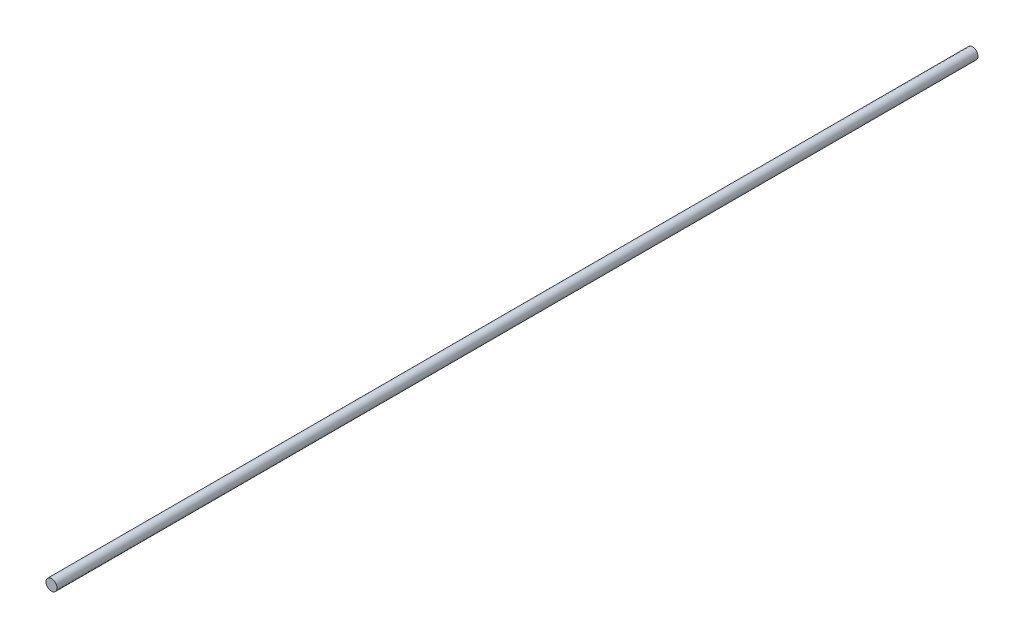
ISO-10303-21;
HEADER;
FILE_DESCRIPTION(('STEP AP214'),'2;1');
FILE_NAME('part.step','',(''),(''),'','','');
FILE_SCHEMA(('AUTOMOTIVE_DESIGN { 1 0 10303 214 1 1 1 1 }'));
ENDSEC;
DATA;
#1=APPLICATION_CONTEXT('core data for automotive mechanical design processes');
#2=APPLICATION_PROTOCOL_DEFINITION('international standard','automotive_design',2000,#1);
#3=PRODUCT_CONTEXT('',#1,'mechanical');
#4=PRODUCT('Part','Part','',(#3));
#5=PRODUCT_RELATED_PRODUCT_CATEGORY('part','',(#4));
#6=PRODUCT_DEFINITION_FORMATION('','',#4);
#7=PRODUCT_DEFINITION_CONTEXT('part definition',#1,'design');
#8=PRODUCT_DEFINITION('design','',#6,#7);
#9=PRODUCT_DEFINITION_SHAPE('','',#8);
#10=(LENGTH_UNIT() NAMED_UNIT(*) SI_UNIT(.MILLI.,.METRE.));
#11=(NAMED_UNIT(*) PLANE_ANGLE_UNIT() SI_UNIT($,.RADIAN.));
#12=(NAMED_UNIT(*) SI_UNIT($,.STERADIAN.) SOLID_ANGLE_UNIT());
#13=UNCERTAINTY_MEASURE_WITH_UNIT(LENGTH_MEASURE(1.E-05),#10,'distance_accuracy_value','');
#14=(GEOMETRIC_REPRESENTATION_CONTEXT(3) GLOBAL_UNCERTAINTY_ASSIGNED_CONTEXT((#13)) GLOBAL_UNIT_ASSIGNED_CONTEXT((#10,
#11,#12)) REPRESENTATION_CONTEXT('',''));
#15=CARTESIAN_POINT('',(0.,0.,0.));
#16=DIRECTION('',(0.,0.,1.));
#17=DIRECTION('',(1.,0.,0.));
#18=AXIS2_PLACEMENT_3D('',#15,#16,#17);
#19=CARTESIAN_POINT('',(0.,0.,532.435));
#20=DIRECTION('',(0.,0.,-1.));
#21=DIRECTION('',(-1.,0.,0.));
#22=AXIS2_PLACEMENT_3D('',#19,#20,#21);
#23=CYLINDRICAL_SURFACE('',#22,3.175);
#24=CARTESIAN_POINT('',(0.,0.,532.435));
#25=DIRECTION('',(0.,0.,1.));
#26=DIRECTION('',(1.,0.,0.));
#27=AXIS2_PLACEMENT_3D('',#24,#25,#26);
#28=CIRCLE('',#27,3.175);
#29=CARTESIAN_POINT('',(3.175,0.,532.435));
#30=VERTEX_POINT('',#29);
#31=EDGE_CURVE('E10',#30,#30,#28,.T.);
#32=ORIENTED_EDGE('',*,*,#31,.F.);
#33=EDGE_LOOP('',(#32));
#34=FACE_BOUND('',#33,.T.);
#35=CARTESIAN_POINT('',(0.,0.,0.));
#36=DIRECTION('',(0.,0.,1.));
#37=DIRECTION('',(1.,0.,0.));
#38=AXIS2_PLACEMENT_3D('',#35,#36,#37);
#39=CIRCLE('',#38,3.175);
#40=CARTESIAN_POINT('',(3.175,0.,0.));
#41=VERTEX_POINT('',#40);
#42=EDGE_CURVE('E38',#41,#41,#39,.T.);
#43=ORIENTED_EDGE('',*,*,#42,.T.);
#44=EDGE_LOOP('',(#43));
#45=FACE_BOUND('',#44,.T.);
#46=ADVANCED_FACE('F35',(#34,#45),#23,.T.);
#47=CARTESIAN_POINT('',(0.,0.,532.435));
#48=DIRECTION('',(0.,0.,1.));
#49=DIRECTION('',(1.,0.,0.));
#50=AXIS2_PLACEMENT_3D('',#47,#48,#49);
#51=PLANE('',#50);
#52=ORIENTED_EDGE('',*,*,#31,.T.);
#53=EDGE_LOOP('',(#52));
#54=FACE_BOUND('',#53,.T.);
#55=ADVANCED_FACE('F50',(#54),#51,.T.);
#56=CARTESIAN_POINT('',(0.,0.,0.));
#57=DIRECTION('',(0.,0.,1.));
#58=DIRECTION('',(1.,0.,0.));
#59=AXIS2_PLACEMENT_3D('',#56,#57,#58);
#60=PLANE('',#59);
#61=ORIENTED_EDGE('',*,*,#42,.F.);
#62=EDGE_LOOP('',(#61));
#63=FACE_BOUND('',#62,.T.);
#64=ADVANCED_FACE('F48',(#63),#60,.F.);
#65=CLOSED_SHELL('',(#46,#55,#64));
#66=MANIFOLD_SOLID_BREP('B2',#65);
#67=ADVANCED_BREP_SHAPE_REPRESENTATION('',(#18,#66),#14);
#68=SHAPE_DEFINITION_REPRESENTATION(#9,#67);
ENDSEC;
END-ISO-10303-21;
